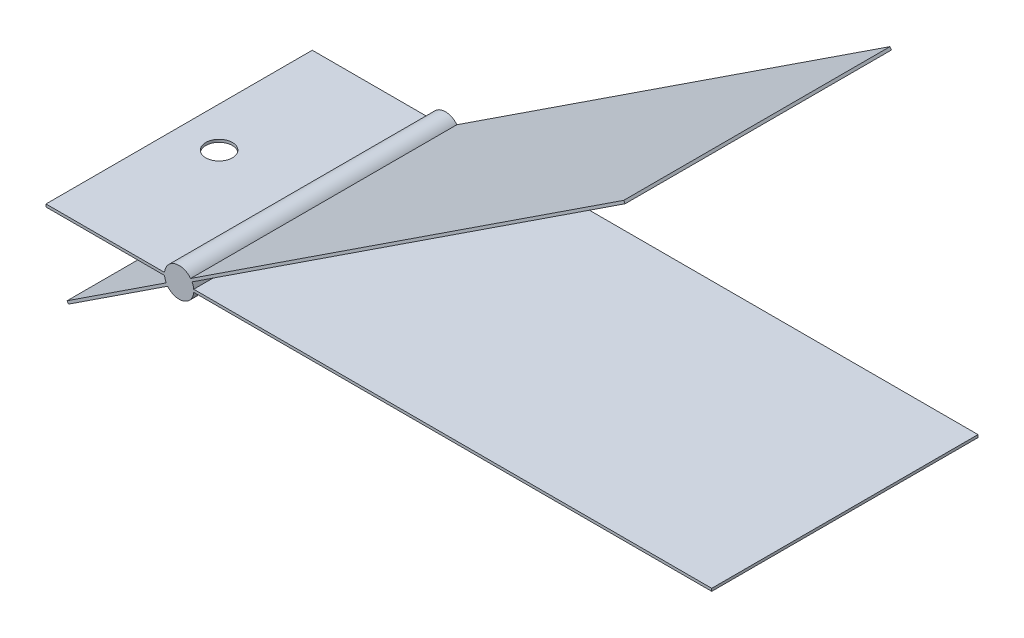
ISO-10303-21;
HEADER;
FILE_DESCRIPTION(('STEP AP214'),'2;1');
FILE_NAME('part.step','',(''),(''),'','','');
FILE_SCHEMA(('AUTOMOTIVE_DESIGN { 1 0 10303 214 1 1 1 1 }'));
ENDSEC;
DATA;
#1=APPLICATION_CONTEXT('core data for automotive mechanical design processes');
#2=APPLICATION_PROTOCOL_DEFINITION('international standard','automotive_design',2000,#1);
#3=PRODUCT_CONTEXT('',#1,'mechanical');
#4=PRODUCT('Part','Part','',(#3));
#5=PRODUCT_RELATED_PRODUCT_CATEGORY('part','',(#4));
#6=PRODUCT_DEFINITION_FORMATION('','',#4);
#7=PRODUCT_DEFINITION_CONTEXT('part definition',#1,'design');
#8=PRODUCT_DEFINITION('design','',#6,#7);
#9=PRODUCT_DEFINITION_SHAPE('','',#8);
#10=(LENGTH_UNIT() NAMED_UNIT(*) SI_UNIT(.MILLI.,.METRE.));
#11=(NAMED_UNIT(*) PLANE_ANGLE_UNIT() SI_UNIT($,.RADIAN.));
#12=(NAMED_UNIT(*) SI_UNIT($,.STERADIAN.) SOLID_ANGLE_UNIT());
#13=UNCERTAINTY_MEASURE_WITH_UNIT(LENGTH_MEASURE(1.E-05),#10,'distance_accuracy_value','');
#14=(GEOMETRIC_REPRESENTATION_CONTEXT(3) GLOBAL_UNCERTAINTY_ASSIGNED_CONTEXT((#13)) GLOBAL_UNIT_ASSIGNED_CONTEXT((#10,
#11,#12)) REPRESENTATION_CONTEXT('',''));
#15=CARTESIAN_POINT('',(0.,0.,0.));
#16=DIRECTION('',(0.,0.,1.));
#17=DIRECTION('',(1.,0.,0.));
#18=AXIS2_PLACEMENT_3D('',#15,#16,#17);
#19=CARTESIAN_POINT('',(-10.,0.1,20.));
#20=DIRECTION('',(0.,-1.,0.));
#21=DIRECTION('',(0.,0.,-1.));
#22=AXIS2_PLACEMENT_3D('',#19,#20,#21);
#23=PLANE('',#22);
#24=DIRECTION('',(-1.,0.,0.));
#25=VECTOR('',#24,1.);
#26=CARTESIAN_POINT('',(-10.,0.1,0.));
#27=LINE('',#26,#25);
#28=CARTESIAN_POINT('',(-1.09544511501033,0.1,0.));
#29=VERTEX_POINT('',#28);
#30=CARTESIAN_POINT('',(-10.,0.1,0.));
#31=VERTEX_POINT('',#30);
#32=EDGE_CURVE('E180',#29,#31,#27,.T.);
#33=ORIENTED_EDGE('',*,*,#32,.T.);
#34=DIRECTION('',(0.,0.,-1.));
#35=VECTOR('',#34,1.);
#36=CARTESIAN_POINT('',(-10.,0.1,20.));
#37=LINE('',#36,#35);
#38=CARTESIAN_POINT('',(-10.,0.1,20.));
#39=VERTEX_POINT('',#38);
#40=EDGE_CURVE('E41',#39,#31,#37,.T.);
#41=ORIENTED_EDGE('',*,*,#40,.F.);
#42=DIRECTION('',(-1.,0.,0.));
#43=VECTOR('',#42,1.);
#44=CARTESIAN_POINT('',(-10.,0.1,20.));
#45=LINE('',#44,#43);
#46=CARTESIAN_POINT('',(-1.09544511501033,0.1,20.));
#47=VERTEX_POINT('',#46);
#48=EDGE_CURVE('E116',#47,#39,#45,.T.);
#49=ORIENTED_EDGE('',*,*,#48,.F.);
#50=DIRECTION('',(0.,0.,-1.));
#51=VECTOR('',#50,1.);
#52=CARTESIAN_POINT('',(-1.09544511501033,0.1,20.));
#53=LINE('',#52,#51);
#54=EDGE_CURVE('E11',#47,#29,#53,.T.);
#55=ORIENTED_EDGE('',*,*,#54,.T.);
#56=EDGE_LOOP('',(#33,#41,#49,#55));
#57=FACE_BOUND('',#56,.T.);
#58=CARTESIAN_POINT('',(-7.,0.0999999999999994,10.));
#59=DIRECTION('',(0.,-1.,0.));
#60=DIRECTION('',(0.,0.,-1.));
#61=AXIS2_PLACEMENT_3D('',#58,#59,#60);
#62=CIRCLE('',#61,1.);
#63=CARTESIAN_POINT('',(-7.,0.0999999999999994,9.));
#64=VERTEX_POINT('',#63);
#65=EDGE_CURVE('E181',#64,#64,#62,.F.);
#66=ORIENTED_EDGE('',*,*,#65,.F.);
#67=EDGE_LOOP('',(#66));
#68=FACE_BOUND('',#67,.T.);
#69=ADVANCED_FACE('F31',(#57,#68),#23,.F.);
#70=CARTESIAN_POINT('',(-10.,-0.1,20.));
#71=DIRECTION('',(0.,1.,0.));
#72=DIRECTION('',(0.,0.,1.));
#73=AXIS2_PLACEMENT_3D('',#70,#71,#72);
#74=PLANE('',#73);
#75=DIRECTION('',(1.,0.,0.));
#76=VECTOR('',#75,1.);
#77=CARTESIAN_POINT('',(-10.,-0.1,0.));
#78=LINE('',#77,#76);
#79=CARTESIAN_POINT('',(-10.,-0.1,0.));
#80=VERTEX_POINT('',#79);
#81=CARTESIAN_POINT('',(-1.09544511501033,-0.0999999999999998,0.));
#82=VERTEX_POINT('',#81);
#83=EDGE_CURVE('E185',#80,#82,#78,.T.);
#84=ORIENTED_EDGE('',*,*,#83,.T.);
#85=DIRECTION('',(0.,0.,-1.));
#86=VECTOR('',#85,1.);
#87=CARTESIAN_POINT('',(-1.09544511501033,-0.0999999999999998,20.));
#88=LINE('',#87,#86);
#89=CARTESIAN_POINT('',(-1.09544511501033,-0.0999999999999998,20.));
#90=VERTEX_POINT('',#89);
#91=EDGE_CURVE('E236',#90,#82,#88,.T.);
#92=ORIENTED_EDGE('',*,*,#91,.F.);
#93=DIRECTION('',(1.,0.,0.));
#94=VECTOR('',#93,1.);
#95=CARTESIAN_POINT('',(-10.,-0.1,20.));
#96=LINE('',#95,#94);
#97=CARTESIAN_POINT('',(-10.,-0.1,20.));
#98=VERTEX_POINT('',#97);
#99=EDGE_CURVE('E267',#98,#90,#96,.T.);
#100=ORIENTED_EDGE('',*,*,#99,.F.);
#101=DIRECTION('',(0.,0.,-1.));
#102=VECTOR('',#101,1.);
#103=CARTESIAN_POINT('',(-10.,-0.1,20.));
#104=LINE('',#103,#102);
#105=EDGE_CURVE('E239',#98,#80,#104,.T.);
#106=ORIENTED_EDGE('',*,*,#105,.T.);
#107=EDGE_LOOP('',(#84,#92,#100,#106));
#108=FACE_BOUND('',#107,.T.);
#109=CARTESIAN_POINT('',(-7.,-0.0999999999999994,10.));
#110=DIRECTION('',(0.,1.,0.));
#111=DIRECTION('',(0.,0.,1.));
#112=AXIS2_PLACEMENT_3D('',#109,#110,#111);
#113=CIRCLE('',#112,1.);
#114=CARTESIAN_POINT('',(-7.,-0.0999999999999994,11.));
#115=VERTEX_POINT('',#114);
#116=EDGE_CURVE('E35',#115,#115,#113,.F.);
#117=ORIENTED_EDGE('',*,*,#116,.F.);
#118=EDGE_LOOP('',(#117));
#119=FACE_BOUND('',#118,.T.);
#120=ADVANCED_FACE('F257',(#108,#119),#74,.F.);
#121=CARTESIAN_POINT('',(0.,0.,20.));
#122=DIRECTION('',(0.,0.,-1.));
#123=DIRECTION('',(-1.,0.,0.));
#124=AXIS2_PLACEMENT_3D('',#121,#122,#123);
#125=CYLINDRICAL_SURFACE('',#124,1.1);
#126=CARTESIAN_POINT('',(0.,0.,0.));
#127=DIRECTION('',(0.,0.,1.));
#128=DIRECTION('',(1.,0.,0.));
#129=AXIS2_PLACEMENT_3D('',#126,#127,#128);
#130=CIRCLE('',#129,1.1);
#131=CARTESIAN_POINT('',(0.861015843057738,0.684581418096907,0.));
#132=VERTEX_POINT('',#131);
#133=EDGE_CURVE('E177',#132,#29,#130,.T.);
#134=ORIENTED_EDGE('',*,*,#133,.T.);
#135=ORIENTED_EDGE('',*,*,#54,.F.);
#136=CARTESIAN_POINT('',(0.,0.,20.));
#137=DIRECTION('',(0.,0.,1.));
#138=DIRECTION('',(1.,0.,0.));
#139=AXIS2_PLACEMENT_3D('',#136,#137,#138);
#140=CIRCLE('',#139,1.1);
#141=CARTESIAN_POINT('',(0.861015843057738,0.684581418096907,20.));
#142=VERTEX_POINT('',#141);
#143=EDGE_CURVE('E208',#142,#47,#140,.T.);
#144=ORIENTED_EDGE('',*,*,#143,.F.);
#145=DIRECTION('',(0.,0.,-1.));
#146=VECTOR('',#145,1.);
#147=CARTESIAN_POINT('',(0.861015843057738,0.684581418096907,20.));
#148=LINE('',#147,#146);
#149=EDGE_CURVE('E173',#142,#132,#148,.T.);
#150=ORIENTED_EDGE('',*,*,#149,.T.);
#151=EDGE_LOOP('',(#134,#135,#144,#150));
#152=FACE_BOUND('',#151,.T.);
#153=ADVANCED_FACE('F33',(#152),#125,.T.);
#154=CARTESIAN_POINT('',(-10.,0.1,20.));
#155=DIRECTION('',(1.,0.,0.));
#156=DIRECTION('',(0.,0.,-1.));
#157=AXIS2_PLACEMENT_3D('',#154,#155,#156);
#158=PLANE('',#157);
#159=DIRECTION('',(0.,-1.,0.));
#160=VECTOR('',#159,1.);
#161=CARTESIAN_POINT('',(-10.,0.1,0.));
#162=LINE('',#161,#160);
#163=EDGE_CURVE('E183',#31,#80,#162,.T.);
#164=ORIENTED_EDGE('',*,*,#163,.T.);
#165=ORIENTED_EDGE('',*,*,#105,.F.);
#166=DIRECTION('',(0.,-1.,0.));
#167=VECTOR('',#166,1.);
#168=CARTESIAN_POINT('',(-10.,0.1,20.));
#169=LINE('',#168,#167);
#170=EDGE_CURVE('E248',#39,#98,#169,.T.);
#171=ORIENTED_EDGE('',*,*,#170,.F.);
#172=ORIENTED_EDGE('',*,*,#40,.T.);
#173=EDGE_LOOP('',(#164,#165,#171,#172));
#174=FACE_BOUND('',#173,.T.);
#175=ADVANCED_FACE('F246',(#174),#158,.F.);
#176=CARTESIAN_POINT('',(0.,0.,20.));
#177=DIRECTION('',(0.,0.,-1.));
#178=DIRECTION('',(-1.,0.,0.));
#179=AXIS2_PLACEMENT_3D('',#176,#177,#178);
#180=CYLINDRICAL_SURFACE('',#179,1.1);
#181=CARTESIAN_POINT('',(0.,0.,0.));
#182=DIRECTION('',(0.,0.,1.));
#183=DIRECTION('',(1.,0.,0.));
#184=AXIS2_PLACEMENT_3D('',#181,#182,#183);
#185=CIRCLE('',#184,1.1);
#186=CARTESIAN_POINT('',(-0.970738121731347,-0.517365923711155,0.));
#187=VERTEX_POINT('',#186);
#188=EDGE_CURVE('E187',#82,#187,#185,.T.);
#189=ORIENTED_EDGE('',*,*,#188,.T.);
#190=DIRECTION('',(0.,0.,-1.));
#191=VECTOR('',#190,1.);
#192=CARTESIAN_POINT('',(-0.970738121731347,-0.517365923711155,20.));
#193=LINE('',#192,#191);
#194=CARTESIAN_POINT('',(-0.970738121731347,-0.517365923711155,20.));
#195=VERTEX_POINT('',#194);
#196=EDGE_CURVE('E233',#195,#187,#193,.T.);
#197=ORIENTED_EDGE('',*,*,#196,.F.);
#198=CARTESIAN_POINT('',(0.,0.,20.));
#199=DIRECTION('',(0.,0.,1.));
#200=DIRECTION('',(1.,0.,0.));
#201=AXIS2_PLACEMENT_3D('',#198,#199,#200);
#202=CIRCLE('',#201,1.1);
#203=EDGE_CURVE('E264',#90,#195,#202,.T.);
#204=ORIENTED_EDGE('',*,*,#203,.F.);
#205=ORIENTED_EDGE('',*,*,#91,.T.);
#206=EDGE_LOOP('',(#189,#197,#204,#205));
#207=FACE_BOUND('',#206,.T.);
#208=ADVANCED_FACE('F262',(#207),#180,.T.);
#209=CARTESIAN_POINT('',(-8.41563585862435,-5.40250618648752,20.));
#210=DIRECTION('',(0.54861139336804,-0.836077471928755,0.));
#211=DIRECTION('',(0.836077471928755,0.54861139336804,0.));
#212=AXIS2_PLACEMENT_3D('',#209,#210,#211);
#213=PLANE('',#212);
#214=CARTESIAN_POINT('',(-5.90740344283809,-3.75667200638341,10.));
#215=DIRECTION('',(0.54861139336804,-0.836077471928755,0.));
#216=DIRECTION('',(0.836077471928755,0.54861139336804,0.));
#217=AXIS2_PLACEMENT_3D('',#214,#215,#216);
#218=CIRCLE('',#217,1.);
#219=CARTESIAN_POINT('',(-5.07132597090934,-3.20806061301537,10.));
#220=VERTEX_POINT('',#219);
#221=EDGE_CURVE('E428',#220,#220,#218,.T.);
#222=ORIENTED_EDGE('',*,*,#221,.T.);
#223=EDGE_LOOP('',(#222));
#224=FACE_BOUND('',#223,.T.);
#225=DIRECTION('',(-0.836077471928755,-0.54861139336804,0.));
#226=VECTOR('',#225,1.);
#227=CARTESIAN_POINT('',(-8.41563585862435,-5.40250618648752,0.));
#228=LINE('',#227,#226);
#229=CARTESIAN_POINT('',(-8.41563585862435,-5.40250618648752,0.));
#230=VERTEX_POINT('',#229);
#231=EDGE_CURVE('E189',#187,#230,#228,.T.);
#232=ORIENTED_EDGE('',*,*,#231,.T.);
#233=DIRECTION('',(0.,0.,-1.));
#234=VECTOR('',#233,1.);
#235=CARTESIAN_POINT('',(-8.41563585862435,-5.40250618648752,20.));
#236=LINE('',#235,#234);
#237=CARTESIAN_POINT('',(-8.41563585862435,-5.40250618648752,20.));
#238=VERTEX_POINT('',#237);
#239=EDGE_CURVE('E230',#238,#230,#236,.T.);
#240=ORIENTED_EDGE('',*,*,#239,.F.);
#241=DIRECTION('',(-0.836077471928755,-0.54861139336804,0.));
#242=VECTOR('',#241,1.);
#243=CARTESIAN_POINT('',(-8.41563585862435,-5.40250618648752,20.));
#244=LINE('',#243,#242);
#245=EDGE_CURVE('E266',#195,#238,#244,.T.);
#246=ORIENTED_EDGE('',*,*,#245,.F.);
#247=ORIENTED_EDGE('',*,*,#196,.T.);
#248=EDGE_LOOP('',(#232,#240,#246,#247));
#249=FACE_BOUND('',#248,.T.);
#250=ADVANCED_FACE('F318',(#224,#249),#213,.F.);
#251=CARTESIAN_POINT('',(-8.41563585862435,-5.40250618648752,20.));
#252=DIRECTION('',(0.836077471928755,0.54861139336804,0.));
#253=DIRECTION('',(-0.54861139336804,0.836077471928755,0.));
#254=AXIS2_PLACEMENT_3D('',#251,#252,#253);
#255=PLANE('',#254);
#256=DIRECTION('',(0.54861139336804,-0.836077471928755,0.));
#257=VECTOR('',#256,1.);
#258=CARTESIAN_POINT('',(-8.41563585862435,-5.40250618648752,0.));
#259=LINE('',#258,#257);
#260=CARTESIAN_POINT('',(-8.30591357995074,-5.56972168087328,0.));
#261=VERTEX_POINT('',#260);
#262=EDGE_CURVE('E191',#230,#261,#259,.T.);
#263=ORIENTED_EDGE('',*,*,#262,.T.);
#264=DIRECTION('',(0.,0.,-1.));
#265=VECTOR('',#264,1.);
#266=CARTESIAN_POINT('',(-8.30591357995074,-5.56972168087328,20.));
#267=LINE('',#266,#265);
#268=CARTESIAN_POINT('',(-8.30591357995074,-5.56972168087328,20.));
#269=VERTEX_POINT('',#268);
#270=EDGE_CURVE('E227',#269,#261,#267,.T.);
#271=ORIENTED_EDGE('',*,*,#270,.F.);
#272=DIRECTION('',(0.54861139336804,-0.836077471928755,0.));
#273=VECTOR('',#272,1.);
#274=CARTESIAN_POINT('',(-8.41563585862435,-5.40250618648752,20.));
#275=LINE('',#274,#273);
#276=EDGE_CURVE('E269',#238,#269,#275,.T.);
#277=ORIENTED_EDGE('',*,*,#276,.F.);
#278=ORIENTED_EDGE('',*,*,#239,.T.);
#279=EDGE_LOOP('',(#263,#271,#277,#278));
#280=FACE_BOUND('',#279,.T.);
#281=ADVANCED_FACE('F321',(#280),#255,.F.);
#282=CARTESIAN_POINT('',(-8.30591357995074,-5.56972168087328,20.));
#283=DIRECTION('',(-0.54861139336804,0.836077471928755,0.));
#284=DIRECTION('',(-0.836077471928755,-0.54861139336804,0.));
#285=AXIS2_PLACEMENT_3D('',#282,#283,#284);
#286=PLANE('',#285);
#287=CARTESIAN_POINT('',(-5.79768116416448,-3.92388750076916,10.));
#288=DIRECTION('',(0.54861139336804,-0.836077471928755,0.));
#289=DIRECTION('',(0.836077471928755,0.54861139336804,0.));
#290=AXIS2_PLACEMENT_3D('',#287,#288,#289);
#291=CIRCLE('',#290,1.);
#292=CARTESIAN_POINT('',(-4.96160369223573,-3.37527610740112,10.));
#293=VERTEX_POINT('',#292);
#294=EDGE_CURVE('E425',#293,#293,#291,.T.);
#295=ORIENTED_EDGE('',*,*,#294,.F.);
#296=EDGE_LOOP('',(#295));
#297=FACE_BOUND('',#296,.T.);
#298=DIRECTION('',(0.836077471928755,0.54861139336804,0.));
#299=VECTOR('',#298,1.);
#300=CARTESIAN_POINT('',(-8.30591357995074,-5.56972168087328,0.));
#301=LINE('',#300,#299);
#302=CARTESIAN_POINT('',(-0.861015843057738,-0.684581418096907,0.));
#303=VERTEX_POINT('',#302);
#304=EDGE_CURVE('E193',#261,#303,#301,.T.);
#305=ORIENTED_EDGE('',*,*,#304,.T.);
#306=DIRECTION('',(0.,0.,-1.));
#307=VECTOR('',#306,1.);
#308=CARTESIAN_POINT('',(-0.861015843057738,-0.684581418096907,20.));
#309=LINE('',#308,#307);
#310=CARTESIAN_POINT('',(-0.861015843057738,-0.684581418096907,20.));
#311=VERTEX_POINT('',#310);
#312=EDGE_CURVE('E224',#311,#303,#309,.T.);
#313=ORIENTED_EDGE('',*,*,#312,.F.);
#314=DIRECTION('',(0.836077471928755,0.54861139336804,0.));
#315=VECTOR('',#314,1.);
#316=CARTESIAN_POINT('',(-8.30591357995074,-5.56972168087328,20.));
#317=LINE('',#316,#315);
#318=EDGE_CURVE('E275',#269,#311,#317,.T.);
#319=ORIENTED_EDGE('',*,*,#318,.F.);
#320=ORIENTED_EDGE('',*,*,#270,.T.);
#321=EDGE_LOOP('',(#305,#313,#319,#320));
#322=FACE_BOUND('',#321,.T.);
#323=ADVANCED_FACE('F325',(#297,#322),#286,.F.);
#324=CARTESIAN_POINT('',(0.,0.,20.));
#325=DIRECTION('',(0.,0.,-1.));
#326=DIRECTION('',(-1.,0.,0.));
#327=AXIS2_PLACEMENT_3D('',#324,#325,#326);
#328=CYLINDRICAL_SURFACE('',#327,1.1);
#329=CARTESIAN_POINT('',(0.,0.,0.));
#330=DIRECTION('',(0.,0.,1.));
#331=DIRECTION('',(1.,0.,0.));
#332=AXIS2_PLACEMENT_3D('',#329,#330,#331);
#333=CIRCLE('',#332,1.1);
#334=CARTESIAN_POINT('',(1.09544511501033,-0.100000000000001,0.));
#335=VERTEX_POINT('',#334);
#336=EDGE_CURVE('E195',#303,#335,#333,.T.);
#337=ORIENTED_EDGE('',*,*,#336,.T.);
#338=DIRECTION('',(0.,0.,-1.));
#339=VECTOR('',#338,1.);
#340=CARTESIAN_POINT('',(1.09544511501033,-0.100000000000001,20.));
#341=LINE('',#340,#339);
#342=CARTESIAN_POINT('',(1.09544511501033,-0.100000000000001,20.));
#343=VERTEX_POINT('',#342);
#344=EDGE_CURVE('E221',#343,#335,#341,.T.);
#345=ORIENTED_EDGE('',*,*,#344,.F.);
#346=CARTESIAN_POINT('',(0.,0.,20.));
#347=DIRECTION('',(0.,0.,1.));
#348=DIRECTION('',(1.,0.,0.));
#349=AXIS2_PLACEMENT_3D('',#346,#347,#348);
#350=CIRCLE('',#349,1.1);
#351=EDGE_CURVE('E277',#311,#343,#350,.T.);
#352=ORIENTED_EDGE('',*,*,#351,.F.);
#353=ORIENTED_EDGE('',*,*,#312,.T.);
#354=EDGE_LOOP('',(#337,#345,#352,#353));
#355=FACE_BOUND('',#354,.T.);
#356=ADVANCED_FACE('F329',(#355),#328,.T.);
#357=CARTESIAN_POINT('',(1.09544511501033,-0.100000000000001,20.));
#358=DIRECTION('',(0.,1.,0.));
#359=DIRECTION('',(-1.,0.,0.));
#360=AXIS2_PLACEMENT_3D('',#357,#358,#359);
#361=PLANE('',#360);
#362=DIRECTION('',(1.,0.,0.));
#363=VECTOR('',#362,1.);
#364=CARTESIAN_POINT('',(1.09544511501033,-0.100000000000001,0.));
#365=LINE('',#364,#363);
#366=CARTESIAN_POINT('',(40.,-0.1,0.));
#367=VERTEX_POINT('',#366);
#368=EDGE_CURVE('E197',#335,#367,#365,.T.);
#369=ORIENTED_EDGE('',*,*,#368,.T.);
#370=DIRECTION('',(0.,0.,-1.));
#371=VECTOR('',#370,1.);
#372=CARTESIAN_POINT('',(40.,-0.1,20.));
#373=LINE('',#372,#371);
#374=CARTESIAN_POINT('',(40.,-0.1,20.));
#375=VERTEX_POINT('',#374);
#376=EDGE_CURVE('E218',#375,#367,#373,.T.);
#377=ORIENTED_EDGE('',*,*,#376,.F.);
#378=DIRECTION('',(1.,0.,0.));
#379=VECTOR('',#378,1.);
#380=CARTESIAN_POINT('',(1.09544511501033,-0.100000000000001,20.));
#381=LINE('',#380,#379);
#382=EDGE_CURVE('E279',#343,#375,#381,.T.);
#383=ORIENTED_EDGE('',*,*,#382,.F.);
#384=ORIENTED_EDGE('',*,*,#344,.T.);
#385=EDGE_LOOP('',(#369,#377,#383,#384));
#386=FACE_BOUND('',#385,.T.);
#387=ADVANCED_FACE('F333',(#386),#361,.F.);
#388=CARTESIAN_POINT('',(40.,0.1,20.));
#389=DIRECTION('',(-1.,0.,0.));
#390=DIRECTION('',(0.,0.,1.));
#391=AXIS2_PLACEMENT_3D('',#388,#389,#390);
#392=PLANE('',#391);
#393=DIRECTION('',(0.,1.,0.));
#394=VECTOR('',#393,1.);
#395=CARTESIAN_POINT('',(40.,0.1,0.));
#396=LINE('',#395,#394);
#397=CARTESIAN_POINT('',(40.,0.1,0.));
#398=VERTEX_POINT('',#397);
#399=EDGE_CURVE('E199',#367,#398,#396,.T.);
#400=ORIENTED_EDGE('',*,*,#399,.T.);
#401=DIRECTION('',(0.,0.,-1.));
#402=VECTOR('',#401,1.);
#403=CARTESIAN_POINT('',(40.,0.1,20.));
#404=LINE('',#403,#402);
#405=CARTESIAN_POINT('',(40.,0.1,20.));
#406=VERTEX_POINT('',#405);
#407=EDGE_CURVE('E215',#406,#398,#404,.T.);
#408=ORIENTED_EDGE('',*,*,#407,.F.);
#409=DIRECTION('',(0.,1.,0.));
#410=VECTOR('',#409,1.);
#411=CARTESIAN_POINT('',(40.,0.1,20.));
#412=LINE('',#411,#410);
#413=EDGE_CURVE('E281',#375,#406,#412,.T.);
#414=ORIENTED_EDGE('',*,*,#413,.F.);
#415=ORIENTED_EDGE('',*,*,#376,.T.);
#416=EDGE_LOOP('',(#400,#408,#414,#415));
#417=FACE_BOUND('',#416,.T.);
#418=ADVANCED_FACE('F337',(#417),#392,.F.);
#419=CARTESIAN_POINT('',(1.09544511501033,0.100000000000001,20.));
#420=DIRECTION('',(0.,-1.,0.));
#421=DIRECTION('',(1.,0.,0.));
#422=AXIS2_PLACEMENT_3D('',#419,#420,#421);
#423=PLANE('',#422);
#424=DIRECTION('',(-1.,0.,0.));
#425=VECTOR('',#424,1.);
#426=CARTESIAN_POINT('',(1.09544511501033,0.100000000000001,0.));
#427=LINE('',#426,#425);
#428=CARTESIAN_POINT('',(1.09544511501033,0.100000000000001,0.));
#429=VERTEX_POINT('',#428);
#430=EDGE_CURVE('E201',#398,#429,#427,.T.);
#431=ORIENTED_EDGE('',*,*,#430,.T.);
#432=DIRECTION('',(0.,0.,-1.));
#433=VECTOR('',#432,1.);
#434=CARTESIAN_POINT('',(1.09544511501033,0.100000000000001,20.));
#435=LINE('',#434,#433);
#436=CARTESIAN_POINT('',(1.09544511501033,0.100000000000001,20.));
#437=VERTEX_POINT('',#436);
#438=EDGE_CURVE('E212',#437,#429,#435,.T.);
#439=ORIENTED_EDGE('',*,*,#438,.F.);
#440=DIRECTION('',(-1.,0.,0.));
#441=VECTOR('',#440,1.);
#442=CARTESIAN_POINT('',(1.09544511501033,0.100000000000001,20.));
#443=LINE('',#442,#441);
#444=EDGE_CURVE('E283',#406,#437,#443,.T.);
#445=ORIENTED_EDGE('',*,*,#444,.F.);
#446=ORIENTED_EDGE('',*,*,#407,.T.);
#447=EDGE_LOOP('',(#431,#439,#445,#446));
#448=FACE_BOUND('',#447,.T.);
#449=ADVANCED_FACE('F289',(#448),#423,.F.);
#450=CARTESIAN_POINT('',(0.,0.,20.));
#451=DIRECTION('',(0.,0.,-1.));
#452=DIRECTION('',(-1.,0.,0.));
#453=AXIS2_PLACEMENT_3D('',#450,#451,#452);
#454=CYLINDRICAL_SURFACE('',#453,1.1);
#455=CARTESIAN_POINT('',(0.,0.,0.));
#456=DIRECTION('',(0.,0.,1.));
#457=DIRECTION('',(1.,0.,0.));
#458=AXIS2_PLACEMENT_3D('',#455,#456,#457);
#459=CIRCLE('',#458,1.1);
#460=CARTESIAN_POINT('',(0.970738121731346,0.517365923711156,0.));
#461=VERTEX_POINT('',#460);
#462=EDGE_CURVE('E203',#429,#461,#459,.T.);
#463=ORIENTED_EDGE('',*,*,#462,.T.);
#464=DIRECTION('',(0.,0.,-1.));
#465=VECTOR('',#464,1.);
#466=CARTESIAN_POINT('',(0.970738121731346,0.517365923711156,20.));
#467=LINE('',#466,#465);
#468=CARTESIAN_POINT('',(0.970738121731346,0.517365923711156,20.));
#469=VERTEX_POINT('',#468);
#470=EDGE_CURVE('E168',#469,#461,#467,.T.);
#471=ORIENTED_EDGE('',*,*,#470,.F.);
#472=CARTESIAN_POINT('',(0.,0.,20.));
#473=DIRECTION('',(0.,0.,1.));
#474=DIRECTION('',(1.,0.,0.));
#475=AXIS2_PLACEMENT_3D('',#472,#473,#474);
#476=CIRCLE('',#475,1.1);
#477=EDGE_CURVE('E159',#437,#469,#476,.T.);
#478=ORIENTED_EDGE('',*,*,#477,.F.);
#479=ORIENTED_EDGE('',*,*,#438,.T.);
#480=EDGE_LOOP('',(#463,#471,#478,#479));
#481=FACE_BOUND('',#480,.T.);
#482=ADVANCED_FACE('F293',(#481),#454,.T.);
#483=CARTESIAN_POINT('',(0.970738121731346,0.517365923711156,20.));
#484=DIRECTION('',(-0.54861139336804,0.836077471928755,0.));
#485=DIRECTION('',(-0.836077471928755,-0.54861139336804,0.));
#486=AXIS2_PLACEMENT_3D('',#483,#484,#485);
#487=PLANE('',#486);
#488=DIRECTION('',(0.836077471928755,0.54861139336804,0.));
#489=VECTOR('',#488,1.);
#490=CARTESIAN_POINT('',(0.970738121731346,0.517365923711156,0.));
#491=LINE('',#490,#489);
#492=CARTESIAN_POINT('',(33.497960016487,21.8608479875287,0.));
#493=VERTEX_POINT('',#492);
#494=EDGE_CURVE('E167',#461,#493,#491,.T.);
#495=ORIENTED_EDGE('',*,*,#494,.T.);
#496=DIRECTION('',(0.,0.,-1.));
#497=VECTOR('',#496,1.);
#498=CARTESIAN_POINT('',(33.497960016487,21.8608479875287,20.));
#499=LINE('',#498,#497);
#500=CARTESIAN_POINT('',(33.497960016487,21.8608479875287,20.));
#501=VERTEX_POINT('',#500);
#502=EDGE_CURVE('E164',#501,#493,#499,.T.);
#503=ORIENTED_EDGE('',*,*,#502,.F.);
#504=DIRECTION('',(0.836077471928755,0.54861139336804,0.));
#505=VECTOR('',#504,1.);
#506=CARTESIAN_POINT('',(0.970738121731346,0.517365923711156,20.));
#507=LINE('',#506,#505);
#508=EDGE_CURVE('E153',#469,#501,#507,.T.);
#509=ORIENTED_EDGE('',*,*,#508,.F.);
#510=ORIENTED_EDGE('',*,*,#470,.T.);
#511=EDGE_LOOP('',(#495,#503,#509,#510));
#512=FACE_BOUND('',#511,.T.);
#513=ADVANCED_FACE('F165',(#512),#487,.F.);
#514=CARTESIAN_POINT('',(33.3882377378134,22.0280634819145,20.));
#515=DIRECTION('',(-0.836077471928765,-0.548611393368024,0.));
#516=DIRECTION('',(0.548611393368024,-0.836077471928766,0.));
#517=AXIS2_PLACEMENT_3D('',#514,#515,#516);
#518=PLANE('',#517);
#519=DIRECTION('',(-0.548611393368024,0.836077471928765,0.));
#520=VECTOR('',#519,1.);
#521=CARTESIAN_POINT('',(33.3882377378134,22.0280634819145,0.));
#522=LINE('',#521,#520);
#523=CARTESIAN_POINT('',(33.3882377378134,22.0280634819145,0.));
#524=VERTEX_POINT('',#523);
#525=EDGE_CURVE('E102',#493,#524,#522,.T.);
#526=ORIENTED_EDGE('',*,*,#525,.T.);
#527=DIRECTION('',(0.,0.,-1.));
#528=VECTOR('',#527,1.);
#529=CARTESIAN_POINT('',(33.3882377378134,22.0280634819145,20.));
#530=LINE('',#529,#528);
#531=CARTESIAN_POINT('',(33.3882377378134,22.0280634819145,20.));
#532=VERTEX_POINT('',#531);
#533=EDGE_CURVE('E169',#532,#524,#530,.T.);
#534=ORIENTED_EDGE('',*,*,#533,.F.);
#535=DIRECTION('',(-0.548611393368024,0.836077471928765,0.));
#536=VECTOR('',#535,1.);
#537=CARTESIAN_POINT('',(33.3882377378134,22.0280634819145,20.));
#538=LINE('',#537,#536);
#539=EDGE_CURVE('E157',#501,#532,#538,.T.);
#540=ORIENTED_EDGE('',*,*,#539,.F.);
#541=ORIENTED_EDGE('',*,*,#502,.T.);
#542=EDGE_LOOP('',(#526,#534,#540,#541));
#543=FACE_BOUND('',#542,.T.);
#544=ADVANCED_FACE('F171',(#543),#518,.F.);
#545=CARTESIAN_POINT('',(0.861015843057738,0.684581418096907,20.));
#546=DIRECTION('',(0.54861139336804,-0.836077471928755,0.));
#547=DIRECTION('',(0.836077471928755,0.54861139336804,0.));
#548=AXIS2_PLACEMENT_3D('',#545,#546,#547);
#549=PLANE('',#548);
#550=DIRECTION('',(-0.836077471928755,-0.54861139336804,0.));
#551=VECTOR('',#550,1.);
#552=CARTESIAN_POINT('',(0.861015843057738,0.684581418096907,0.));
#553=LINE('',#552,#551);
#554=EDGE_CURVE('E108',#524,#132,#553,.T.);
#555=ORIENTED_EDGE('',*,*,#554,.T.);
#556=ORIENTED_EDGE('',*,*,#149,.F.);
#557=DIRECTION('',(-0.836077471928755,-0.54861139336804,0.));
#558=VECTOR('',#557,1.);
#559=CARTESIAN_POINT('',(0.861015843057738,0.684581418096907,20.));
#560=LINE('',#559,#558);
#561=EDGE_CURVE('E49',#532,#142,#560,.T.);
#562=ORIENTED_EDGE('',*,*,#561,.F.);
#563=ORIENTED_EDGE('',*,*,#533,.T.);
#564=EDGE_LOOP('',(#555,#556,#562,#563));
#565=FACE_BOUND('',#564,.T.);
#566=ADVANCED_FACE('F297',(#565),#549,.F.);
#567=CARTESIAN_POINT('',(0.,0.,20.));
#568=DIRECTION('',(0.,0.,1.));
#569=DIRECTION('',(1.,0.,0.));
#570=AXIS2_PLACEMENT_3D('',#567,#568,#569);
#571=PLANE('',#570);
#572=ORIENTED_EDGE('',*,*,#143,.T.);
#573=ORIENTED_EDGE('',*,*,#48,.T.);
#574=ORIENTED_EDGE('',*,*,#170,.T.);
#575=ORIENTED_EDGE('',*,*,#99,.T.);
#576=ORIENTED_EDGE('',*,*,#203,.T.);
#577=ORIENTED_EDGE('',*,*,#245,.T.);
#578=ORIENTED_EDGE('',*,*,#276,.T.);
#579=ORIENTED_EDGE('',*,*,#318,.T.);
#580=ORIENTED_EDGE('',*,*,#351,.T.);
#581=ORIENTED_EDGE('',*,*,#382,.T.);
#582=ORIENTED_EDGE('',*,*,#413,.T.);
#583=ORIENTED_EDGE('',*,*,#444,.T.);
#584=ORIENTED_EDGE('',*,*,#477,.T.);
#585=ORIENTED_EDGE('',*,*,#508,.T.);
#586=ORIENTED_EDGE('',*,*,#539,.T.);
#587=ORIENTED_EDGE('',*,*,#561,.T.);
#588=EDGE_LOOP('',(#572,#573,#574,#575,#576,#577,#578,#579,#580,#581,#582,#583,#584,#585,#586,#587));
#589=FACE_BOUND('',#588,.T.);
#590=ADVANCED_FACE('F155',(#589),#571,.T.);
#591=CARTESIAN_POINT('',(0.,0.,0.));
#592=DIRECTION('',(0.,0.,1.));
#593=DIRECTION('',(1.,0.,0.));
#594=AXIS2_PLACEMENT_3D('',#591,#592,#593);
#595=PLANE('',#594);
#596=ORIENTED_EDGE('',*,*,#133,.F.);
#597=ORIENTED_EDGE('',*,*,#554,.F.);
#598=ORIENTED_EDGE('',*,*,#525,.F.);
#599=ORIENTED_EDGE('',*,*,#494,.F.);
#600=ORIENTED_EDGE('',*,*,#462,.F.);
#601=ORIENTED_EDGE('',*,*,#430,.F.);
#602=ORIENTED_EDGE('',*,*,#399,.F.);
#603=ORIENTED_EDGE('',*,*,#368,.F.);
#604=ORIENTED_EDGE('',*,*,#336,.F.);
#605=ORIENTED_EDGE('',*,*,#304,.F.);
#606=ORIENTED_EDGE('',*,*,#262,.F.);
#607=ORIENTED_EDGE('',*,*,#231,.F.);
#608=ORIENTED_EDGE('',*,*,#188,.F.);
#609=ORIENTED_EDGE('',*,*,#83,.F.);
#610=ORIENTED_EDGE('',*,*,#163,.F.);
#611=ORIENTED_EDGE('',*,*,#32,.F.);
#612=EDGE_LOOP('',(#596,#597,#598,#599,#600,#601,#602,#603,#604,#605,#606,#607,#608,#609,#610,#611));
#613=FACE_BOUND('',#612,.T.);
#614=ADVANCED_FACE('F252',(#613),#595,.F.);
#615=CARTESIAN_POINT('',(-7.,20.1,10.));
#616=DIRECTION('',(0.,-1.,0.));
#617=DIRECTION('',(0.,0.,-1.));
#618=AXIS2_PLACEMENT_3D('',#615,#616,#617);
#619=CYLINDRICAL_SURFACE('',#618,1.);
#620=ORIENTED_EDGE('',*,*,#116,.T.);
#621=EDGE_LOOP('',(#620));
#622=FACE_BOUND('',#621,.T.);
#623=ORIENTED_EDGE('',*,*,#65,.T.);
#624=EDGE_LOOP('',(#623));
#625=FACE_BOUND('',#624,.T.);
#626=ADVANCED_FACE('F373',(#622,#625),#619,.F.);
#627=CARTESIAN_POINT('',(-6.34629255753252,-3.08781002884041,10.));
#628=DIRECTION('',(0.54861139336804,-0.836077471928755,0.));
#629=DIRECTION('',(0.836077471928755,0.54861139336804,0.));
#630=AXIS2_PLACEMENT_3D('',#627,#628,#629);
#631=CYLINDRICAL_SURFACE('',#630,1.);
#632=ORIENTED_EDGE('',*,*,#294,.T.);
#633=EDGE_LOOP('',(#632));
#634=FACE_BOUND('',#633,.T.);
#635=ORIENTED_EDGE('',*,*,#221,.F.);
#636=EDGE_LOOP('',(#635));
#637=FACE_BOUND('',#636,.T.);
#638=ADVANCED_FACE('F393',(#634,#637),#631,.F.);
#639=CLOSED_SHELL('',(#69,#120,#153,#175,#208,#250,#281,#323,#356,#387,#418,#449,#482,#513,#544,
#566,#590,#614,#626,#638));
#640=MANIFOLD_SOLID_BREP('B2',#639);
#641=ADVANCED_BREP_SHAPE_REPRESENTATION('',(#18,#640),#14);
#642=SHAPE_DEFINITION_REPRESENTATION(#9,#641);
ENDSEC;
END-ISO-10303-21;
